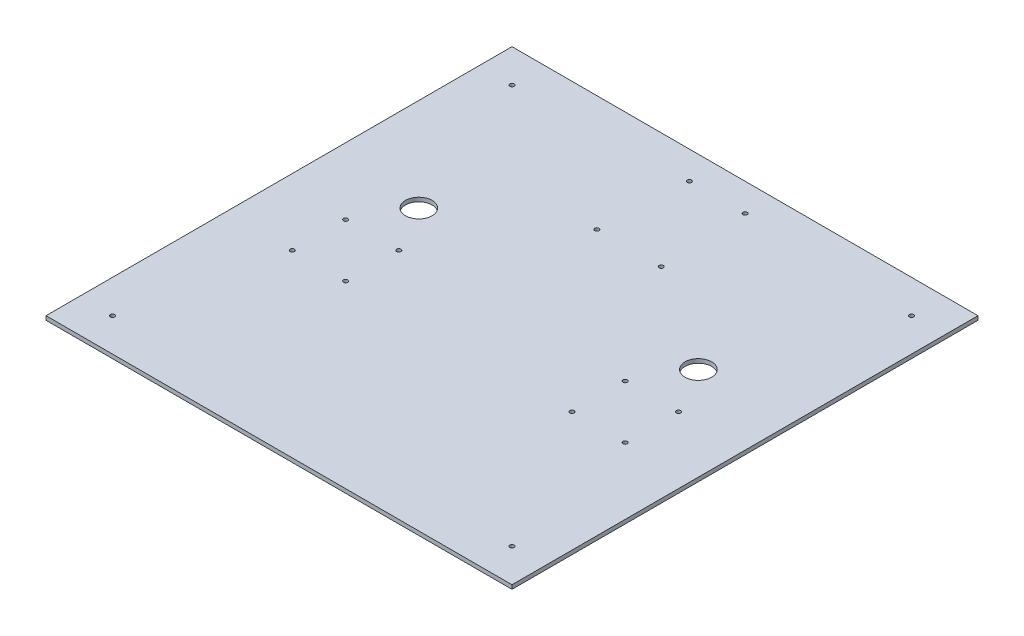
ISO-10303-21;
HEADER;
FILE_DESCRIPTION(('STEP AP214'),'2;1');
FILE_NAME('part.step','',(''),(''),'','','');
FILE_SCHEMA(('AUTOMOTIVE_DESIGN { 1 0 10303 214 1 1 1 1 }'));
ENDSEC;
DATA;
#1=APPLICATION_CONTEXT('core data for automotive mechanical design processes');
#2=APPLICATION_PROTOCOL_DEFINITION('international standard','automotive_design',2000,#1);
#3=PRODUCT_CONTEXT('',#1,'mechanical');
#4=PRODUCT('Part','Part','',(#3));
#5=PRODUCT_RELATED_PRODUCT_CATEGORY('part','',(#4));
#6=PRODUCT_DEFINITION_FORMATION('','',#4);
#7=PRODUCT_DEFINITION_CONTEXT('part definition',#1,'design');
#8=PRODUCT_DEFINITION('design','',#6,#7);
#9=PRODUCT_DEFINITION_SHAPE('','',#8);
#10=(LENGTH_UNIT() NAMED_UNIT(*) SI_UNIT(.MILLI.,.METRE.));
#11=(NAMED_UNIT(*) PLANE_ANGLE_UNIT() SI_UNIT($,.RADIAN.));
#12=(NAMED_UNIT(*) SI_UNIT($,.STERADIAN.) SOLID_ANGLE_UNIT());
#13=UNCERTAINTY_MEASURE_WITH_UNIT(LENGTH_MEASURE(1.E-05),#10,'distance_accuracy_value','');
#14=(GEOMETRIC_REPRESENTATION_CONTEXT(3) GLOBAL_UNCERTAINTY_ASSIGNED_CONTEXT((#13)) GLOBAL_UNIT_ASSIGNED_CONTEXT((#10,
#11,#12)) REPRESENTATION_CONTEXT('',''));
#15=CARTESIAN_POINT('',(0.,0.,0.));
#16=DIRECTION('',(0.,0.,1.));
#17=DIRECTION('',(1.,0.,0.));
#18=AXIS2_PLACEMENT_3D('',#15,#16,#17);
#19=CARTESIAN_POINT('',(0.,3.,0.));
#20=DIRECTION('',(0.,-1.,0.));
#21=DIRECTION('',(0.,0.,-1.));
#22=AXIS2_PLACEMENT_3D('',#19,#20,#21);
#23=PLANE('',#22);
#24=CARTESIAN_POINT('',(24.1555881317814,3.,-87.9285497318701));
#25=DIRECTION('',(0.,1.,0.));
#26=DIRECTION('',(0.,0.,1.));
#27=AXIS2_PLACEMENT_3D('',#24,#25,#26);
#28=CIRCLE('',#27,1.60000000000001);
#29=CARTESIAN_POINT('',(24.1555881317814,3.,-86.3285497318701));
#30=VERTEX_POINT('',#29);
#31=EDGE_CURVE('E173',#30,#30,#28,.T.);
#32=ORIENTED_EDGE('',*,*,#31,.F.);
#33=EDGE_LOOP('',(#32));
#34=FACE_BOUND('',#33,.T.);
#35=CARTESIAN_POINT('',(-125.,3.,0.));
#36=DIRECTION('',(0.,1.,0.));
#37=DIRECTION('',(0.,0.,1.));
#38=AXIS2_PLACEMENT_3D('',#35,#36,#37);
#39=CIRCLE('',#38,1.60000000000002);
#40=CARTESIAN_POINT('',(-125.,3.,1.60000000000002));
#41=VERTEX_POINT('',#40);
#42=EDGE_CURVE('E166',#41,#41,#39,.T.);
#43=ORIENTED_EDGE('',*,*,#42,.F.);
#44=EDGE_LOOP('',(#43));
#45=FACE_BOUND('',#44,.T.);
#46=CARTESIAN_POINT('',(-85.,3.,0.));
#47=DIRECTION('',(0.,1.,0.));
#48=DIRECTION('',(0.,0.,1.));
#49=AXIS2_PLACEMENT_3D('',#46,#47,#48);
#50=CIRCLE('',#49,1.60000000000002);
#51=CARTESIAN_POINT('',(-85.,3.,1.60000000000002));
#52=VERTEX_POINT('',#51);
#53=EDGE_CURVE('E185',#52,#52,#50,.T.);
#54=ORIENTED_EDGE('',*,*,#53,.F.);
#55=EDGE_LOOP('',(#54));
#56=FACE_BOUND('',#55,.T.);
#57=CARTESIAN_POINT('',(-125.,3.,40.));
#58=DIRECTION('',(0.,1.,0.));
#59=DIRECTION('',(0.,0.,1.));
#60=AXIS2_PLACEMENT_3D('',#57,#58,#59);
#61=CIRCLE('',#60,1.60000000000002);
#62=CARTESIAN_POINT('',(-125.,3.,41.6));
#63=VERTEX_POINT('',#62);
#64=EDGE_CURVE('E178',#63,#63,#61,.T.);
#65=ORIENTED_EDGE('',*,*,#64,.F.);
#66=EDGE_LOOP('',(#65));
#67=FACE_BOUND('',#66,.T.);
#68=CARTESIAN_POINT('',(105.,3.,-35.));
#69=DIRECTION('',(0.,1.,0.));
#70=DIRECTION('',(0.,0.,1.));
#71=AXIS2_PLACEMENT_3D('',#68,#69,#70);
#72=CIRCLE('',#71,9.99999999999999);
#73=CARTESIAN_POINT('',(105.,3.,-25.));
#74=VERTEX_POINT('',#73);
#75=EDGE_CURVE('E149',#74,#74,#72,.T.);
#76=ORIENTED_EDGE('',*,*,#75,.F.);
#77=EDGE_LOOP('',(#76));
#78=FACE_BOUND('',#77,.T.);
#79=CARTESIAN_POINT('',(-20.8615999619881,3.,-154.02854973187));
#80=DIRECTION('',(0.,1.,0.));
#81=DIRECTION('',(0.,0.,1.));
#82=AXIS2_PLACEMENT_3D('',#79,#80,#81);
#83=CIRCLE('',#82,1.59999999999999);
#84=CARTESIAN_POINT('',(-20.8615999619881,3.,-152.42854973187));
#85=VERTEX_POINT('',#84);
#86=EDGE_CURVE('E142',#85,#85,#83,.T.);
#87=ORIENTED_EDGE('',*,*,#86,.F.);
#88=EDGE_LOOP('',(#87));
#89=FACE_BOUND('',#88,.T.);
#90=CARTESIAN_POINT('',(-24.2344118682186,3.,-87.9285497318701));
#91=DIRECTION('',(0.,1.,0.));
#92=DIRECTION('',(0.,0.,1.));
#93=AXIS2_PLACEMENT_3D('',#90,#91,#92);
#94=CIRCLE('',#93,1.60000000000001);
#95=CARTESIAN_POINT('',(-24.2344118682186,3.,-86.3285497318701));
#96=VERTEX_POINT('',#95);
#97=EDGE_CURVE('E161',#96,#96,#94,.T.);
#98=ORIENTED_EDGE('',*,*,#97,.F.);
#99=EDGE_LOOP('',(#98));
#100=FACE_BOUND('',#99,.T.);
#101=CARTESIAN_POINT('',(21.0484000380119,3.,-154.02854973187));
#102=DIRECTION('',(0.,1.,0.));
#103=DIRECTION('',(0.,0.,1.));
#104=AXIS2_PLACEMENT_3D('',#101,#102,#103);
#105=CIRCLE('',#104,1.59999999999999);
#106=CARTESIAN_POINT('',(21.0484000380119,3.,-152.42854973187));
#107=VERTEX_POINT('',#106);
#108=EDGE_CURVE('E154',#107,#107,#105,.T.);
#109=ORIENTED_EDGE('',*,*,#108,.F.);
#110=EDGE_LOOP('',(#109));
#111=FACE_BOUND('',#110,.T.);
#112=CARTESIAN_POINT('',(125.,3.,40.));
#113=DIRECTION('',(0.,1.,0.));
#114=DIRECTION('',(0.,0.,1.));
#115=AXIS2_PLACEMENT_3D('',#112,#113,#114);
#116=CIRCLE('',#115,1.60000000000002);
#117=CARTESIAN_POINT('',(125.,3.,41.6));
#118=VERTEX_POINT('',#117);
#119=EDGE_CURVE('E214',#118,#118,#116,.T.);
#120=ORIENTED_EDGE('',*,*,#119,.F.);
#121=EDGE_LOOP('',(#120));
#122=FACE_BOUND('',#121,.T.);
#123=CARTESIAN_POINT('',(-85.,3.,40.));
#124=DIRECTION('',(0.,1.,0.));
#125=DIRECTION('',(0.,0.,1.));
#126=AXIS2_PLACEMENT_3D('',#123,#124,#125);
#127=CIRCLE('',#126,1.60000000000002);
#128=CARTESIAN_POINT('',(-85.,3.,41.6));
#129=VERTEX_POINT('',#128);
#130=EDGE_CURVE('E197',#129,#129,#127,.T.);
#131=ORIENTED_EDGE('',*,*,#130,.F.);
#132=EDGE_LOOP('',(#131));
#133=FACE_BOUND('',#132,.T.);
#134=CARTESIAN_POINT('',(85.,3.,0.));
#135=DIRECTION('',(0.,1.,0.));
#136=DIRECTION('',(0.,0.,1.));
#137=AXIS2_PLACEMENT_3D('',#134,#135,#136);
#138=CIRCLE('',#137,1.60000000000002);
#139=CARTESIAN_POINT('',(85.,3.,1.60000000000002));
#140=VERTEX_POINT('',#139);
#141=EDGE_CURVE('E190',#140,#140,#138,.T.);
#142=ORIENTED_EDGE('',*,*,#141,.F.);
#143=EDGE_LOOP('',(#142));
#144=FACE_BOUND('',#143,.T.);
#145=CARTESIAN_POINT('',(125.,3.,0.));
#146=DIRECTION('',(0.,1.,0.));
#147=DIRECTION('',(0.,0.,1.));
#148=AXIS2_PLACEMENT_3D('',#145,#146,#147);
#149=CIRCLE('',#148,1.60000000000002);
#150=CARTESIAN_POINT('',(125.,3.,1.60000000000002));
#151=VERTEX_POINT('',#150);
#152=EDGE_CURVE('E209',#151,#151,#149,.T.);
#153=ORIENTED_EDGE('',*,*,#152,.F.);
#154=EDGE_LOOP('',(#153));
#155=FACE_BOUND('',#154,.T.);
#156=CARTESIAN_POINT('',(85.,3.,40.));
#157=DIRECTION('',(0.,1.,0.));
#158=DIRECTION('',(0.,0.,1.));
#159=AXIS2_PLACEMENT_3D('',#156,#157,#158);
#160=CIRCLE('',#159,1.60000000000002);
#161=CARTESIAN_POINT('',(85.,3.,41.6));
#162=VERTEX_POINT('',#161);
#163=EDGE_CURVE('E202',#162,#162,#160,.T.);
#164=ORIENTED_EDGE('',*,*,#163,.F.);
#165=EDGE_LOOP('',(#164));
#166=FACE_BOUND('',#165,.T.);
#167=CARTESIAN_POINT('',(-105.,3.,-35.));
#168=DIRECTION('',(0.,1.,0.));
#169=DIRECTION('',(0.,0.,1.));
#170=AXIS2_PLACEMENT_3D('',#167,#168,#169);
#171=CIRCLE('',#170,9.99999999999999);
#172=CARTESIAN_POINT('',(-105.,3.,-25.));
#173=VERTEX_POINT('',#172);
#174=EDGE_CURVE('E136',#173,#173,#171,.T.);
#175=ORIENTED_EDGE('',*,*,#174,.F.);
#176=EDGE_LOOP('',(#175));
#177=FACE_BOUND('',#176,.T.);
#178=DIRECTION('',(0.,0.,-1.));
#179=VECTOR('',#178,1.);
#180=CARTESIAN_POINT('',(175.000000049266,3.,175.000000049266));
#181=LINE('',#180,#179);
#182=CARTESIAN_POINT('',(175.000000049266,3.,175.000000049266));
#183=VERTEX_POINT('',#182);
#184=CARTESIAN_POINT('',(175.000000049266,3.,-175.000000049266));
#185=VERTEX_POINT('',#184);
#186=EDGE_CURVE('E85',#183,#185,#181,.T.);
#187=ORIENTED_EDGE('',*,*,#186,.T.);
#188=DIRECTION('',(-1.,0.,0.));
#189=VECTOR('',#188,1.);
#190=CARTESIAN_POINT('',(-175.000000049266,3.,-175.000000049266));
#191=LINE('',#190,#189);
#192=CARTESIAN_POINT('',(-175.000000049266,3.,-175.000000049266));
#193=VERTEX_POINT('',#192);
#194=EDGE_CURVE('E80',#185,#193,#191,.T.);
#195=ORIENTED_EDGE('',*,*,#194,.T.);
#196=DIRECTION('',(0.,0.,1.));
#197=VECTOR('',#196,1.);
#198=CARTESIAN_POINT('',(-175.000000049266,3.,175.000000049266));
#199=LINE('',#198,#197);
#200=CARTESIAN_POINT('',(-175.000000049266,3.,175.000000049266));
#201=VERTEX_POINT('',#200);
#202=EDGE_CURVE('E83',#193,#201,#199,.T.);
#203=ORIENTED_EDGE('',*,*,#202,.T.);
#204=DIRECTION('',(1.,0.,0.));
#205=VECTOR('',#204,1.);
#206=CARTESIAN_POINT('',(-175.000000049266,3.,175.000000049266));
#207=LINE('',#206,#205);
#208=EDGE_CURVE('E50',#201,#183,#207,.T.);
#209=ORIENTED_EDGE('',*,*,#208,.T.);
#210=EDGE_LOOP('',(#187,#195,#203,#209));
#211=FACE_BOUND('',#210,.T.);
#212=CARTESIAN_POINT('',(-150.,3.,-150.));
#213=DIRECTION('',(0.,1.,0.));
#214=DIRECTION('',(0.,0.,1.));
#215=AXIS2_PLACEMENT_3D('',#212,#213,#214);
#216=CIRCLE('',#215,1.59999999999999);
#217=CARTESIAN_POINT('',(-150.,3.,-148.4));
#218=VERTEX_POINT('',#217);
#219=EDGE_CURVE('E100',#218,#218,#216,.T.);
#220=ORIENTED_EDGE('',*,*,#219,.F.);
#221=EDGE_LOOP('',(#220));
#222=FACE_BOUND('',#221,.T.);
#223=CARTESIAN_POINT('',(-150.,3.,150.));
#224=DIRECTION('',(0.,1.,0.));
#225=DIRECTION('',(0.,0.,1.));
#226=AXIS2_PLACEMENT_3D('',#223,#224,#225);
#227=CIRCLE('',#226,1.59999999999999);
#228=CARTESIAN_POINT('',(-150.,3.,151.6));
#229=VERTEX_POINT('',#228);
#230=EDGE_CURVE('E115',#229,#229,#227,.T.);
#231=ORIENTED_EDGE('',*,*,#230,.F.);
#232=EDGE_LOOP('',(#231));
#233=FACE_BOUND('',#232,.T.);
#234=CARTESIAN_POINT('',(150.,3.,150.));
#235=DIRECTION('',(0.,1.,0.));
#236=DIRECTION('',(0.,0.,1.));
#237=AXIS2_PLACEMENT_3D('',#234,#235,#236);
#238=CIRCLE('',#237,1.59999999999999);
#239=CARTESIAN_POINT('',(150.,3.,151.6));
#240=VERTEX_POINT('',#239);
#241=EDGE_CURVE('E121',#240,#240,#238,.T.);
#242=ORIENTED_EDGE('',*,*,#241,.F.);
#243=EDGE_LOOP('',(#242));
#244=FACE_BOUND('',#243,.T.);
#245=CARTESIAN_POINT('',(150.,3.,-150.));
#246=DIRECTION('',(0.,1.,0.));
#247=DIRECTION('',(0.,0.,1.));
#248=AXIS2_PLACEMENT_3D('',#245,#246,#247);
#249=CIRCLE('',#248,1.59999999999999);
#250=CARTESIAN_POINT('',(150.,3.,-148.4));
#251=VERTEX_POINT('',#250);
#252=EDGE_CURVE('E127',#251,#251,#249,.T.);
#253=ORIENTED_EDGE('',*,*,#252,.F.);
#254=EDGE_LOOP('',(#253));
#255=FACE_BOUND('',#254,.T.);
#256=ADVANCED_FACE('F33',(#34,#45,#56,#67,#78,#89,#100,#111,#122,#133,#144,#155,#166,#177,#211,
#222,#233,#244,#255),#23,.F.);
#257=CARTESIAN_POINT('',(0.,0.,0.));
#258=DIRECTION('',(0.,-1.,0.));
#259=DIRECTION('',(0.,0.,-1.));
#260=AXIS2_PLACEMENT_3D('',#257,#258,#259);
#261=PLANE('',#260);
#262=CARTESIAN_POINT('',(24.1555881317814,0.,-87.9285497318701));
#263=DIRECTION('',(0.,1.,0.));
#264=DIRECTION('',(0.,0.,1.));
#265=AXIS2_PLACEMENT_3D('',#262,#263,#264);
#266=CIRCLE('',#265,1.60000000000001);
#267=CARTESIAN_POINT('',(24.1555881317814,0.,-86.3285497318701));
#268=VERTEX_POINT('',#267);
#269=EDGE_CURVE('E158',#268,#268,#266,.T.);
#270=ORIENTED_EDGE('',*,*,#269,.T.);
#271=EDGE_LOOP('',(#270));
#272=FACE_BOUND('',#271,.T.);
#273=CARTESIAN_POINT('',(-125.,0.,0.));
#274=DIRECTION('',(0.,1.,0.));
#275=DIRECTION('',(0.,0.,1.));
#276=AXIS2_PLACEMENT_3D('',#273,#274,#275);
#277=CIRCLE('',#276,1.60000000000002);
#278=CARTESIAN_POINT('',(-125.,0.,1.60000000000002));
#279=VERTEX_POINT('',#278);
#280=EDGE_CURVE('E169',#279,#279,#277,.T.);
#281=ORIENTED_EDGE('',*,*,#280,.T.);
#282=EDGE_LOOP('',(#281));
#283=FACE_BOUND('',#282,.T.);
#284=CARTESIAN_POINT('',(-85.,0.,0.));
#285=DIRECTION('',(0.,1.,0.));
#286=DIRECTION('',(0.,0.,1.));
#287=AXIS2_PLACEMENT_3D('',#284,#285,#286);
#288=CIRCLE('',#287,1.60000000000002);
#289=CARTESIAN_POINT('',(-85.,0.,1.60000000000002));
#290=VERTEX_POINT('',#289);
#291=EDGE_CURVE('E170',#290,#290,#288,.T.);
#292=ORIENTED_EDGE('',*,*,#291,.T.);
#293=EDGE_LOOP('',(#292));
#294=FACE_BOUND('',#293,.T.);
#295=CARTESIAN_POINT('',(-125.,0.,40.));
#296=DIRECTION('',(0.,1.,0.));
#297=DIRECTION('',(0.,0.,1.));
#298=AXIS2_PLACEMENT_3D('',#295,#296,#297);
#299=CIRCLE('',#298,1.60000000000002);
#300=CARTESIAN_POINT('',(-125.,0.,41.6));
#301=VERTEX_POINT('',#300);
#302=EDGE_CURVE('E181',#301,#301,#299,.T.);
#303=ORIENTED_EDGE('',*,*,#302,.T.);
#304=EDGE_LOOP('',(#303));
#305=FACE_BOUND('',#304,.T.);
#306=CARTESIAN_POINT('',(105.,0.,-35.));
#307=DIRECTION('',(0.,1.,0.));
#308=DIRECTION('',(0.,0.,1.));
#309=AXIS2_PLACEMENT_3D('',#306,#307,#308);
#310=CIRCLE('',#309,9.99999999999999);
#311=CARTESIAN_POINT('',(105.,0.,-25.));
#312=VERTEX_POINT('',#311);
#313=EDGE_CURVE('E139',#312,#312,#310,.T.);
#314=ORIENTED_EDGE('',*,*,#313,.T.);
#315=EDGE_LOOP('',(#314));
#316=FACE_BOUND('',#315,.T.);
#317=CARTESIAN_POINT('',(-20.8615999619881,0.,-154.02854973187));
#318=DIRECTION('',(0.,1.,0.));
#319=DIRECTION('',(0.,0.,1.));
#320=AXIS2_PLACEMENT_3D('',#317,#318,#319);
#321=CIRCLE('',#320,1.59999999999999);
#322=CARTESIAN_POINT('',(-20.8615999619881,0.,-152.42854973187));
#323=VERTEX_POINT('',#322);
#324=EDGE_CURVE('E145',#323,#323,#321,.T.);
#325=ORIENTED_EDGE('',*,*,#324,.T.);
#326=EDGE_LOOP('',(#325));
#327=FACE_BOUND('',#326,.T.);
#328=CARTESIAN_POINT('',(-24.2344118682186,0.,-87.9285497318701));
#329=DIRECTION('',(0.,1.,0.));
#330=DIRECTION('',(0.,0.,1.));
#331=AXIS2_PLACEMENT_3D('',#328,#329,#330);
#332=CIRCLE('',#331,1.60000000000001);
#333=CARTESIAN_POINT('',(-24.2344118682186,0.,-86.3285497318701));
#334=VERTEX_POINT('',#333);
#335=EDGE_CURVE('E146',#334,#334,#332,.T.);
#336=ORIENTED_EDGE('',*,*,#335,.T.);
#337=EDGE_LOOP('',(#336));
#338=FACE_BOUND('',#337,.T.);
#339=CARTESIAN_POINT('',(21.0484000380119,0.,-154.02854973187));
#340=DIRECTION('',(0.,1.,0.));
#341=DIRECTION('',(0.,0.,1.));
#342=AXIS2_PLACEMENT_3D('',#339,#340,#341);
#343=CIRCLE('',#342,1.59999999999999);
#344=CARTESIAN_POINT('',(21.0484000380119,0.,-152.42854973187));
#345=VERTEX_POINT('',#344);
#346=EDGE_CURVE('E157',#345,#345,#343,.T.);
#347=ORIENTED_EDGE('',*,*,#346,.T.);
#348=EDGE_LOOP('',(#347));
#349=FACE_BOUND('',#348,.T.);
#350=CARTESIAN_POINT('',(125.,0.,40.));
#351=DIRECTION('',(0.,1.,0.));
#352=DIRECTION('',(0.,0.,1.));
#353=AXIS2_PLACEMENT_3D('',#350,#351,#352);
#354=CIRCLE('',#353,1.60000000000002);
#355=CARTESIAN_POINT('',(125.,0.,41.6));
#356=VERTEX_POINT('',#355);
#357=EDGE_CURVE('E206',#356,#356,#354,.T.);
#358=ORIENTED_EDGE('',*,*,#357,.T.);
#359=EDGE_LOOP('',(#358));
#360=FACE_BOUND('',#359,.T.);
#361=CARTESIAN_POINT('',(-85.,0.,40.));
#362=DIRECTION('',(0.,1.,0.));
#363=DIRECTION('',(0.,0.,1.));
#364=AXIS2_PLACEMENT_3D('',#361,#362,#363);
#365=CIRCLE('',#364,1.60000000000002);
#366=CARTESIAN_POINT('',(-85.,0.,41.6));
#367=VERTEX_POINT('',#366);
#368=EDGE_CURVE('E182',#367,#367,#365,.T.);
#369=ORIENTED_EDGE('',*,*,#368,.T.);
#370=EDGE_LOOP('',(#369));
#371=FACE_BOUND('',#370,.T.);
#372=CARTESIAN_POINT('',(85.,0.,0.));
#373=DIRECTION('',(0.,1.,0.));
#374=DIRECTION('',(0.,0.,1.));
#375=AXIS2_PLACEMENT_3D('',#372,#373,#374);
#376=CIRCLE('',#375,1.60000000000002);
#377=CARTESIAN_POINT('',(85.,0.,1.60000000000002));
#378=VERTEX_POINT('',#377);
#379=EDGE_CURVE('E193',#378,#378,#376,.T.);
#380=ORIENTED_EDGE('',*,*,#379,.T.);
#381=EDGE_LOOP('',(#380));
#382=FACE_BOUND('',#381,.T.);
#383=CARTESIAN_POINT('',(125.,0.,0.));
#384=DIRECTION('',(0.,1.,0.));
#385=DIRECTION('',(0.,0.,1.));
#386=AXIS2_PLACEMENT_3D('',#383,#384,#385);
#387=CIRCLE('',#386,1.60000000000002);
#388=CARTESIAN_POINT('',(125.,0.,1.60000000000002));
#389=VERTEX_POINT('',#388);
#390=EDGE_CURVE('E194',#389,#389,#387,.T.);
#391=ORIENTED_EDGE('',*,*,#390,.T.);
#392=EDGE_LOOP('',(#391));
#393=FACE_BOUND('',#392,.T.);
#394=CARTESIAN_POINT('',(85.,0.,40.));
#395=DIRECTION('',(0.,1.,0.));
#396=DIRECTION('',(0.,0.,1.));
#397=AXIS2_PLACEMENT_3D('',#394,#395,#396);
#398=CIRCLE('',#397,1.60000000000002);
#399=CARTESIAN_POINT('',(85.,0.,41.6));
#400=VERTEX_POINT('',#399);
#401=EDGE_CURVE('E205',#400,#400,#398,.T.);
#402=ORIENTED_EDGE('',*,*,#401,.T.);
#403=EDGE_LOOP('',(#402));
#404=FACE_BOUND('',#403,.T.);
#405=CARTESIAN_POINT('',(-105.,0.,-35.));
#406=DIRECTION('',(0.,1.,0.));
#407=DIRECTION('',(0.,0.,1.));
#408=AXIS2_PLACEMENT_3D('',#405,#406,#407);
#409=CIRCLE('',#408,9.99999999999999);
#410=CARTESIAN_POINT('',(-105.,0.,-25.));
#411=VERTEX_POINT('',#410);
#412=EDGE_CURVE('E133',#411,#411,#409,.T.);
#413=ORIENTED_EDGE('',*,*,#412,.T.);
#414=EDGE_LOOP('',(#413));
#415=FACE_BOUND('',#414,.T.);
#416=CARTESIAN_POINT('',(150.,0.,150.));
#417=DIRECTION('',(0.,1.,0.));
#418=DIRECTION('',(0.,0.,1.));
#419=AXIS2_PLACEMENT_3D('',#416,#417,#418);
#420=CIRCLE('',#419,1.59999999999999);
#421=CARTESIAN_POINT('',(150.,0.,151.6));
#422=VERTEX_POINT('',#421);
#423=EDGE_CURVE('E124',#422,#422,#420,.T.);
#424=ORIENTED_EDGE('',*,*,#423,.T.);
#425=EDGE_LOOP('',(#424));
#426=FACE_BOUND('',#425,.T.);
#427=CARTESIAN_POINT('',(-150.,0.,-150.));
#428=DIRECTION('',(0.,1.,0.));
#429=DIRECTION('',(0.,0.,1.));
#430=AXIS2_PLACEMENT_3D('',#427,#428,#429);
#431=CIRCLE('',#430,1.59999999999999);
#432=CARTESIAN_POINT('',(-150.,0.,-148.4));
#433=VERTEX_POINT('',#432);
#434=EDGE_CURVE('E112',#433,#433,#431,.T.);
#435=ORIENTED_EDGE('',*,*,#434,.T.);
#436=EDGE_LOOP('',(#435));
#437=FACE_BOUND('',#436,.T.);
#438=DIRECTION('',(0.,0.,-1.));
#439=VECTOR('',#438,1.);
#440=CARTESIAN_POINT('',(175.000000049266,0.,175.000000049266));
#441=LINE('',#440,#439);
#442=CARTESIAN_POINT('',(175.000000049266,0.,175.000000049266));
#443=VERTEX_POINT('',#442);
#444=CARTESIAN_POINT('',(175.000000049266,0.,-175.000000049266));
#445=VERTEX_POINT('',#444);
#446=EDGE_CURVE('E97',#443,#445,#441,.T.);
#447=ORIENTED_EDGE('',*,*,#446,.F.);
#448=DIRECTION('',(1.,0.,0.));
#449=VECTOR('',#448,1.);
#450=CARTESIAN_POINT('',(-175.000000049266,0.,175.000000049266));
#451=LINE('',#450,#449);
#452=CARTESIAN_POINT('',(-175.000000049266,0.,175.000000049266));
#453=VERTEX_POINT('',#452);
#454=EDGE_CURVE('E73',#453,#443,#451,.T.);
#455=ORIENTED_EDGE('',*,*,#454,.F.);
#456=DIRECTION('',(0.,0.,1.));
#457=VECTOR('',#456,1.);
#458=CARTESIAN_POINT('',(-175.000000049266,0.,175.000000049266));
#459=LINE('',#458,#457);
#460=CARTESIAN_POINT('',(-175.000000049266,0.,-175.000000049266));
#461=VERTEX_POINT('',#460);
#462=EDGE_CURVE('E67',#461,#453,#459,.T.);
#463=ORIENTED_EDGE('',*,*,#462,.F.);
#464=DIRECTION('',(-1.,0.,0.));
#465=VECTOR('',#464,1.);
#466=CARTESIAN_POINT('',(-175.000000049266,0.,-175.000000049266));
#467=LINE('',#466,#465);
#468=EDGE_CURVE('E89',#445,#461,#467,.T.);
#469=ORIENTED_EDGE('',*,*,#468,.F.);
#470=EDGE_LOOP('',(#447,#455,#463,#469));
#471=FACE_BOUND('',#470,.T.);
#472=CARTESIAN_POINT('',(-150.,0.,150.));
#473=DIRECTION('',(0.,1.,0.));
#474=DIRECTION('',(0.,0.,1.));
#475=AXIS2_PLACEMENT_3D('',#472,#473,#474);
#476=CIRCLE('',#475,1.59999999999999);
#477=CARTESIAN_POINT('',(-150.,0.,151.6));
#478=VERTEX_POINT('',#477);
#479=EDGE_CURVE('E118',#478,#478,#476,.T.);
#480=ORIENTED_EDGE('',*,*,#479,.T.);
#481=EDGE_LOOP('',(#480));
#482=FACE_BOUND('',#481,.T.);
#483=CARTESIAN_POINT('',(150.,0.,-150.));
#484=DIRECTION('',(0.,1.,0.));
#485=DIRECTION('',(0.,0.,1.));
#486=AXIS2_PLACEMENT_3D('',#483,#484,#485);
#487=CIRCLE('',#486,1.59999999999999);
#488=CARTESIAN_POINT('',(150.,0.,-148.4));
#489=VERTEX_POINT('',#488);
#490=EDGE_CURVE('E130',#489,#489,#487,.T.);
#491=ORIENTED_EDGE('',*,*,#490,.T.);
#492=EDGE_LOOP('',(#491));
#493=FACE_BOUND('',#492,.T.);
#494=ADVANCED_FACE('F108',(#272,#283,#294,#305,#316,#327,#338,#349,#360,#371,#382,#393,#404,
#415,#426,#437,#471,#482,#493),#261,.T.);
#495=CARTESIAN_POINT('',(175.000000049266,3.,175.000000049266));
#496=DIRECTION('',(-1.,0.,0.));
#497=DIRECTION('',(0.,0.,1.));
#498=AXIS2_PLACEMENT_3D('',#495,#496,#497);
#499=PLANE('',#498);
#500=ORIENTED_EDGE('',*,*,#446,.T.);
#501=DIRECTION('',(0.,-1.,0.));
#502=VECTOR('',#501,1.);
#503=CARTESIAN_POINT('',(175.000000049266,3.,-175.000000049266));
#504=LINE('',#503,#502);
#505=EDGE_CURVE('E11',#185,#445,#504,.T.);
#506=ORIENTED_EDGE('',*,*,#505,.F.);
#507=ORIENTED_EDGE('',*,*,#186,.F.);
#508=DIRECTION('',(0.,-1.,0.));
#509=VECTOR('',#508,1.);
#510=CARTESIAN_POINT('',(175.000000049266,3.,175.000000049266));
#511=LINE('',#510,#509);
#512=EDGE_CURVE('E93',#183,#443,#511,.T.);
#513=ORIENTED_EDGE('',*,*,#512,.T.);
#514=EDGE_LOOP('',(#500,#506,#507,#513));
#515=FACE_BOUND('',#514,.T.);
#516=ADVANCED_FACE('F35',(#515),#499,.F.);
#517=CARTESIAN_POINT('',(-175.000000049266,3.,-175.000000049266));
#518=DIRECTION('',(0.,0.,1.));
#519=DIRECTION('',(1.,0.,0.));
#520=AXIS2_PLACEMENT_3D('',#517,#518,#519);
#521=PLANE('',#520);
#522=ORIENTED_EDGE('',*,*,#468,.T.);
#523=DIRECTION('',(0.,-1.,0.));
#524=VECTOR('',#523,1.);
#525=CARTESIAN_POINT('',(-175.000000049266,3.,-175.000000049266));
#526=LINE('',#525,#524);
#527=EDGE_CURVE('E42',#193,#461,#526,.T.);
#528=ORIENTED_EDGE('',*,*,#527,.F.);
#529=ORIENTED_EDGE('',*,*,#194,.F.);
#530=ORIENTED_EDGE('',*,*,#505,.T.);
#531=EDGE_LOOP('',(#522,#528,#529,#530));
#532=FACE_BOUND('',#531,.T.);
#533=ADVANCED_FACE('F88',(#532),#521,.F.);
#534=CARTESIAN_POINT('',(-175.000000049266,3.,175.000000049266));
#535=DIRECTION('',(1.,0.,0.));
#536=DIRECTION('',(0.,0.,-1.));
#537=AXIS2_PLACEMENT_3D('',#534,#535,#536);
#538=PLANE('',#537);
#539=ORIENTED_EDGE('',*,*,#462,.T.);
#540=DIRECTION('',(0.,-1.,0.));
#541=VECTOR('',#540,1.);
#542=CARTESIAN_POINT('',(-175.000000049266,3.,175.000000049266));
#543=LINE('',#542,#541);
#544=EDGE_CURVE('E90',#201,#453,#543,.T.);
#545=ORIENTED_EDGE('',*,*,#544,.F.);
#546=ORIENTED_EDGE('',*,*,#202,.F.);
#547=ORIENTED_EDGE('',*,*,#527,.T.);
#548=EDGE_LOOP('',(#539,#545,#546,#547));
#549=FACE_BOUND('',#548,.T.);
#550=ADVANCED_FACE('F91',(#549),#538,.F.);
#551=CARTESIAN_POINT('',(-175.000000049266,3.,175.000000049266));
#552=DIRECTION('',(0.,0.,-1.));
#553=DIRECTION('',(-1.,0.,0.));
#554=AXIS2_PLACEMENT_3D('',#551,#552,#553);
#555=PLANE('',#554);
#556=ORIENTED_EDGE('',*,*,#454,.T.);
#557=ORIENTED_EDGE('',*,*,#512,.F.);
#558=ORIENTED_EDGE('',*,*,#208,.F.);
#559=ORIENTED_EDGE('',*,*,#544,.T.);
#560=EDGE_LOOP('',(#556,#557,#558,#559));
#561=FACE_BOUND('',#560,.T.);
#562=ADVANCED_FACE('F105',(#561),#555,.F.);
#563=CARTESIAN_POINT('',(-150.,3.,-150.));
#564=DIRECTION('',(0.,-1.,0.));
#565=DIRECTION('',(0.,0.,-1.));
#566=AXIS2_PLACEMENT_3D('',#563,#564,#565);
#567=CYLINDRICAL_SURFACE('',#566,1.59999999999999);
#568=ORIENTED_EDGE('',*,*,#219,.T.);
#569=EDGE_LOOP('',(#568));
#570=FACE_BOUND('',#569,.T.);
#571=ORIENTED_EDGE('',*,*,#434,.F.);
#572=EDGE_LOOP('',(#571));
#573=FACE_BOUND('',#572,.T.);
#574=ADVANCED_FACE('F271',(#570,#573),#567,.F.);
#575=CARTESIAN_POINT('',(-150.,3.,150.));
#576=DIRECTION('',(0.,-1.,0.));
#577=DIRECTION('',(0.,0.,-1.));
#578=AXIS2_PLACEMENT_3D('',#575,#576,#577);
#579=CYLINDRICAL_SURFACE('',#578,1.59999999999999);
#580=ORIENTED_EDGE('',*,*,#230,.T.);
#581=EDGE_LOOP('',(#580));
#582=FACE_BOUND('',#581,.T.);
#583=ORIENTED_EDGE('',*,*,#479,.F.);
#584=EDGE_LOOP('',(#583));
#585=FACE_BOUND('',#584,.T.);
#586=ADVANCED_FACE('F267',(#582,#585),#579,.F.);
#587=CARTESIAN_POINT('',(150.,3.,150.));
#588=DIRECTION('',(0.,-1.,0.));
#589=DIRECTION('',(0.,0.,-1.));
#590=AXIS2_PLACEMENT_3D('',#587,#588,#589);
#591=CYLINDRICAL_SURFACE('',#590,1.59999999999999);
#592=ORIENTED_EDGE('',*,*,#241,.T.);
#593=EDGE_LOOP('',(#592));
#594=FACE_BOUND('',#593,.T.);
#595=ORIENTED_EDGE('',*,*,#423,.F.);
#596=EDGE_LOOP('',(#595));
#597=FACE_BOUND('',#596,.T.);
#598=ADVANCED_FACE('F257',(#594,#597),#591,.F.);
#599=CARTESIAN_POINT('',(150.,3.,-150.));
#600=DIRECTION('',(0.,-1.,0.));
#601=DIRECTION('',(0.,0.,-1.));
#602=AXIS2_PLACEMENT_3D('',#599,#600,#601);
#603=CYLINDRICAL_SURFACE('',#602,1.59999999999999);
#604=ORIENTED_EDGE('',*,*,#252,.T.);
#605=EDGE_LOOP('',(#604));
#606=FACE_BOUND('',#605,.T.);
#607=ORIENTED_EDGE('',*,*,#490,.F.);
#608=EDGE_LOOP('',(#607));
#609=FACE_BOUND('',#608,.T.);
#610=ADVANCED_FACE('F247',(#606,#609),#603,.F.);
#611=CARTESIAN_POINT('',(-105.,0.,-35.));
#612=DIRECTION('',(0.,1.,0.));
#613=DIRECTION('',(0.,0.,1.));
#614=AXIS2_PLACEMENT_3D('',#611,#612,#613);
#615=CYLINDRICAL_SURFACE('',#614,9.99999999999999);
#616=ORIENTED_EDGE('',*,*,#412,.F.);
#617=EDGE_LOOP('',(#616));
#618=FACE_BOUND('',#617,.T.);
#619=ORIENTED_EDGE('',*,*,#174,.T.);
#620=EDGE_LOOP('',(#619));
#621=FACE_BOUND('',#620,.T.);
#622=ADVANCED_FACE('F244',(#618,#621),#615,.F.);
#623=CARTESIAN_POINT('',(85.,0.,40.));
#624=DIRECTION('',(0.,1.,0.));
#625=DIRECTION('',(0.,0.,1.));
#626=AXIS2_PLACEMENT_3D('',#623,#624,#625);
#627=CYLINDRICAL_SURFACE('',#626,1.60000000000002);
#628=ORIENTED_EDGE('',*,*,#401,.F.);
#629=EDGE_LOOP('',(#628));
#630=FACE_BOUND('',#629,.T.);
#631=ORIENTED_EDGE('',*,*,#163,.T.);
#632=EDGE_LOOP('',(#631));
#633=FACE_BOUND('',#632,.T.);
#634=ADVANCED_FACE('F246',(#630,#633),#627,.F.);
#635=CARTESIAN_POINT('',(125.,0.,0.));
#636=DIRECTION('',(0.,1.,0.));
#637=DIRECTION('',(0.,0.,1.));
#638=AXIS2_PLACEMENT_3D('',#635,#636,#637);
#639=CYLINDRICAL_SURFACE('',#638,1.60000000000002);
#640=ORIENTED_EDGE('',*,*,#390,.F.);
#641=EDGE_LOOP('',(#640));
#642=FACE_BOUND('',#641,.T.);
#643=ORIENTED_EDGE('',*,*,#152,.T.);
#644=EDGE_LOOP('',(#643));
#645=FACE_BOUND('',#644,.T.);
#646=ADVANCED_FACE('F254',(#642,#645),#639,.F.);
#647=CARTESIAN_POINT('',(85.,0.,0.));
#648=DIRECTION('',(0.,1.,0.));
#649=DIRECTION('',(0.,0.,1.));
#650=AXIS2_PLACEMENT_3D('',#647,#648,#649);
#651=CYLINDRICAL_SURFACE('',#650,1.60000000000002);
#652=ORIENTED_EDGE('',*,*,#379,.F.);
#653=EDGE_LOOP('',(#652));
#654=FACE_BOUND('',#653,.T.);
#655=ORIENTED_EDGE('',*,*,#141,.T.);
#656=EDGE_LOOP('',(#655));
#657=FACE_BOUND('',#656,.T.);
#658=ADVANCED_FACE('F359',(#654,#657),#651,.F.);
#659=CARTESIAN_POINT('',(-85.,0.,40.));
#660=DIRECTION('',(0.,1.,0.));
#661=DIRECTION('',(0.,0.,1.));
#662=AXIS2_PLACEMENT_3D('',#659,#660,#661);
#663=CYLINDRICAL_SURFACE('',#662,1.60000000000002);
#664=ORIENTED_EDGE('',*,*,#368,.F.);
#665=EDGE_LOOP('',(#664));
#666=FACE_BOUND('',#665,.T.);
#667=ORIENTED_EDGE('',*,*,#130,.T.);
#668=EDGE_LOOP('',(#667));
#669=FACE_BOUND('',#668,.T.);
#670=ADVANCED_FACE('F226',(#666,#669),#663,.F.);
#671=CARTESIAN_POINT('',(125.,0.,40.));
#672=DIRECTION('',(0.,1.,0.));
#673=DIRECTION('',(0.,0.,1.));
#674=AXIS2_PLACEMENT_3D('',#671,#672,#673);
#675=CYLINDRICAL_SURFACE('',#674,1.60000000000002);
#676=ORIENTED_EDGE('',*,*,#357,.F.);
#677=EDGE_LOOP('',(#676));
#678=FACE_BOUND('',#677,.T.);
#679=ORIENTED_EDGE('',*,*,#119,.T.);
#680=EDGE_LOOP('',(#679));
#681=FACE_BOUND('',#680,.T.);
#682=ADVANCED_FACE('F222',(#678,#681),#675,.F.);
#683=CARTESIAN_POINT('',(21.0484000380119,0.,-154.02854973187));
#684=DIRECTION('',(0.,1.,0.));
#685=DIRECTION('',(0.,0.,1.));
#686=AXIS2_PLACEMENT_3D('',#683,#684,#685);
#687=CYLINDRICAL_SURFACE('',#686,1.59999999999999);
#688=ORIENTED_EDGE('',*,*,#346,.F.);
#689=EDGE_LOOP('',(#688));
#690=FACE_BOUND('',#689,.T.);
#691=ORIENTED_EDGE('',*,*,#108,.T.);
#692=EDGE_LOOP('',(#691));
#693=FACE_BOUND('',#692,.T.);
#694=ADVANCED_FACE('F225',(#690,#693),#687,.F.);
#695=CARTESIAN_POINT('',(-24.2344118682186,0.,-87.9285497318701));
#696=DIRECTION('',(0.,1.,0.));
#697=DIRECTION('',(0.,0.,1.));
#698=AXIS2_PLACEMENT_3D('',#695,#696,#697);
#699=CYLINDRICAL_SURFACE('',#698,1.60000000000001);
#700=ORIENTED_EDGE('',*,*,#335,.F.);
#701=EDGE_LOOP('',(#700));
#702=FACE_BOUND('',#701,.T.);
#703=ORIENTED_EDGE('',*,*,#97,.T.);
#704=EDGE_LOOP('',(#703));
#705=FACE_BOUND('',#704,.T.);
#706=ADVANCED_FACE('F389',(#702,#705),#699,.F.);
#707=CARTESIAN_POINT('',(-20.8615999619881,0.,-154.02854973187));
#708=DIRECTION('',(0.,1.,0.));
#709=DIRECTION('',(0.,0.,1.));
#710=AXIS2_PLACEMENT_3D('',#707,#708,#709);
#711=CYLINDRICAL_SURFACE('',#710,1.59999999999999);
#712=ORIENTED_EDGE('',*,*,#324,.F.);
#713=EDGE_LOOP('',(#712));
#714=FACE_BOUND('',#713,.T.);
#715=ORIENTED_EDGE('',*,*,#86,.T.);
#716=EDGE_LOOP('',(#715));
#717=FACE_BOUND('',#716,.T.);
#718=ADVANCED_FACE('F262',(#714,#717),#711,.F.);
#719=CARTESIAN_POINT('',(105.,0.,-35.));
#720=DIRECTION('',(0.,1.,0.));
#721=DIRECTION('',(0.,0.,1.));
#722=AXIS2_PLACEMENT_3D('',#719,#720,#721);
#723=CYLINDRICAL_SURFACE('',#722,9.99999999999999);
#724=ORIENTED_EDGE('',*,*,#313,.F.);
#725=EDGE_LOOP('',(#724));
#726=FACE_BOUND('',#725,.T.);
#727=ORIENTED_EDGE('',*,*,#75,.T.);
#728=EDGE_LOOP('',(#727));
#729=FACE_BOUND('',#728,.T.);
#730=ADVANCED_FACE('F406',(#726,#729),#723,.F.);
#731=CARTESIAN_POINT('',(-125.,0.,40.));
#732=DIRECTION('',(0.,1.,0.));
#733=DIRECTION('',(0.,0.,1.));
#734=AXIS2_PLACEMENT_3D('',#731,#732,#733);
#735=CYLINDRICAL_SURFACE('',#734,1.60000000000002);
#736=ORIENTED_EDGE('',*,*,#302,.F.);
#737=EDGE_LOOP('',(#736));
#738=FACE_BOUND('',#737,.T.);
#739=ORIENTED_EDGE('',*,*,#64,.T.);
#740=EDGE_LOOP('',(#739));
#741=FACE_BOUND('',#740,.T.);
#742=ADVANCED_FACE('F414',(#738,#741),#735,.F.);
#743=CARTESIAN_POINT('',(-85.,0.,0.));
#744=DIRECTION('',(0.,1.,0.));
#745=DIRECTION('',(0.,0.,1.));
#746=AXIS2_PLACEMENT_3D('',#743,#744,#745);
#747=CYLINDRICAL_SURFACE('',#746,1.60000000000002);
#748=ORIENTED_EDGE('',*,*,#291,.F.);
#749=EDGE_LOOP('',(#748));
#750=FACE_BOUND('',#749,.T.);
#751=ORIENTED_EDGE('',*,*,#53,.T.);
#752=EDGE_LOOP('',(#751));
#753=FACE_BOUND('',#752,.T.);
#754=ADVANCED_FACE('F422',(#750,#753),#747,.F.);
#755=CARTESIAN_POINT('',(-125.,0.,0.));
#756=DIRECTION('',(0.,1.,0.));
#757=DIRECTION('',(0.,0.,1.));
#758=AXIS2_PLACEMENT_3D('',#755,#756,#757);
#759=CYLINDRICAL_SURFACE('',#758,1.60000000000002);
#760=ORIENTED_EDGE('',*,*,#280,.F.);
#761=EDGE_LOOP('',(#760));
#762=FACE_BOUND('',#761,.T.);
#763=ORIENTED_EDGE('',*,*,#42,.T.);
#764=EDGE_LOOP('',(#763));
#765=FACE_BOUND('',#764,.T.);
#766=ADVANCED_FACE('F431',(#762,#765),#759,.F.);
#767=CARTESIAN_POINT('',(24.1555881317814,0.,-87.9285497318701));
#768=DIRECTION('',(0.,1.,0.));
#769=DIRECTION('',(0.,0.,1.));
#770=AXIS2_PLACEMENT_3D('',#767,#768,#769);
#771=CYLINDRICAL_SURFACE('',#770,1.60000000000001);
#772=ORIENTED_EDGE('',*,*,#269,.F.);
#773=EDGE_LOOP('',(#772));
#774=FACE_BOUND('',#773,.T.);
#775=ORIENTED_EDGE('',*,*,#31,.T.);
#776=EDGE_LOOP('',(#775));
#777=FACE_BOUND('',#776,.T.);
#778=ADVANCED_FACE('F440',(#774,#777),#771,.F.);
#779=CLOSED_SHELL('',(#256,#494,#516,#533,#550,#562,#574,#586,#598,#610,#622,#634,#646,#658,
#670,#682,#694,#706,#718,#730,#742,#754,#766,#778));
#780=MANIFOLD_SOLID_BREP('B2',#779);
#781=ADVANCED_BREP_SHAPE_REPRESENTATION('',(#18,#780),#14);
#782=SHAPE_DEFINITION_REPRESENTATION(#9,#781);
ENDSEC;
END-ISO-10303-21;
